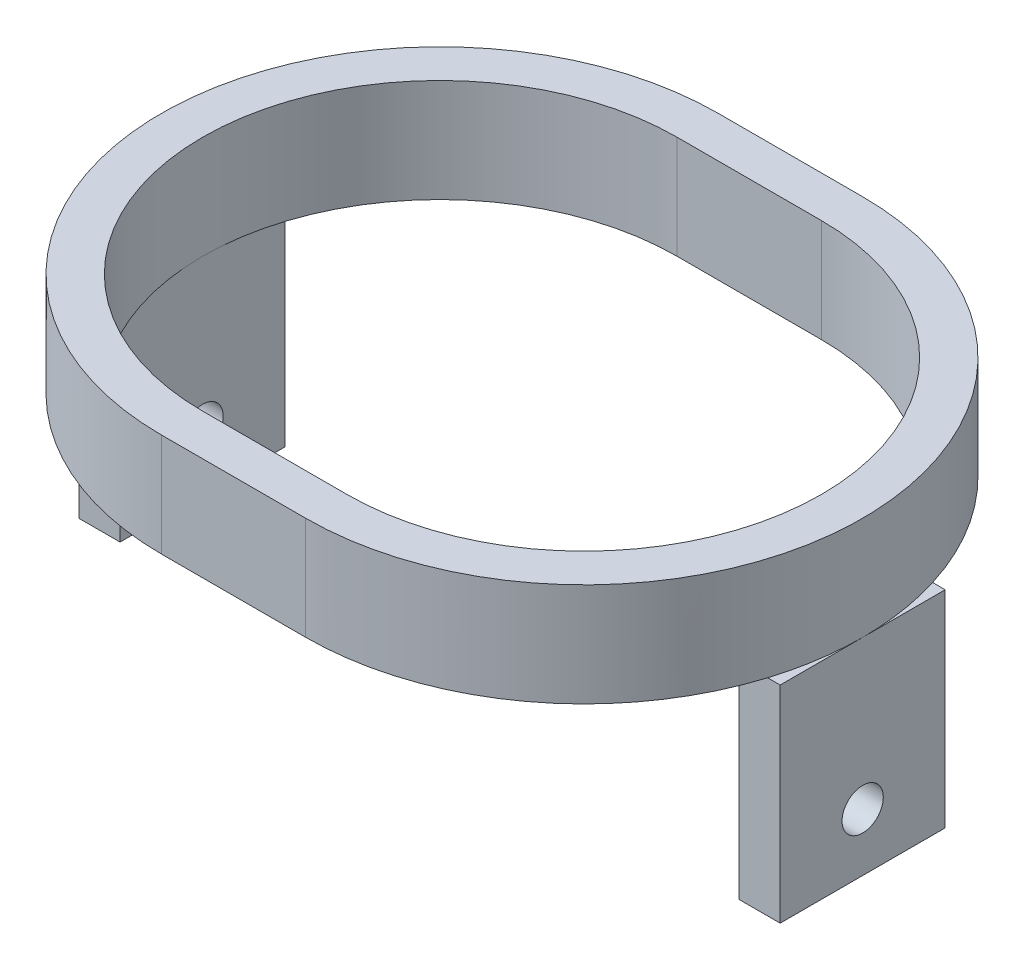
ISO-10303-21;
HEADER;
FILE_DESCRIPTION(('STEP AP214'),'2;1');
FILE_NAME('part.step','',(''),(''),'','','');
FILE_SCHEMA(('AUTOMOTIVE_DESIGN { 1 0 10303 214 1 1 1 1 }'));
ENDSEC;
DATA;
#1=APPLICATION_CONTEXT('core data for automotive mechanical design processes');
#2=APPLICATION_PROTOCOL_DEFINITION('international standard','automotive_design',2000,#1);
#3=PRODUCT_CONTEXT('',#1,'mechanical');
#4=PRODUCT('Part','Part','',(#3));
#5=PRODUCT_RELATED_PRODUCT_CATEGORY('part','',(#4));
#6=PRODUCT_DEFINITION_FORMATION('','',#4);
#7=PRODUCT_DEFINITION_CONTEXT('part definition',#1,'design');
#8=PRODUCT_DEFINITION('design','',#6,#7);
#9=PRODUCT_DEFINITION_SHAPE('','',#8);
#10=(LENGTH_UNIT() NAMED_UNIT(*) SI_UNIT(.MILLI.,.METRE.));
#11=(NAMED_UNIT(*) PLANE_ANGLE_UNIT() SI_UNIT($,.RADIAN.));
#12=(NAMED_UNIT(*) SI_UNIT($,.STERADIAN.) SOLID_ANGLE_UNIT());
#13=UNCERTAINTY_MEASURE_WITH_UNIT(LENGTH_MEASURE(1.E-05),#10,'distance_accuracy_value','');
#14=(GEOMETRIC_REPRESENTATION_CONTEXT(3) GLOBAL_UNCERTAINTY_ASSIGNED_CONTEXT((#13)) GLOBAL_UNIT_ASSIGNED_CONTEXT((#10,
#11,#12)) REPRESENTATION_CONTEXT('',''));
#15=CARTESIAN_POINT('',(0.,0.,0.));
#16=DIRECTION('',(0.,0.,1.));
#17=DIRECTION('',(1.,0.,0.));
#18=AXIS2_PLACEMENT_3D('',#15,#16,#17);
#19=CARTESIAN_POINT('',(-7.00000000000001,0.,0.));
#20=DIRECTION('',(0.,1.,0.));
#21=DIRECTION('',(0.,0.,1.));
#22=AXIS2_PLACEMENT_3D('',#19,#20,#21);
#23=PLANE('',#22);
#24=DIRECTION('',(-1.,0.,0.));
#25=VECTOR('',#24,1.);
#26=CARTESIAN_POINT('',(34.,0.,8.));
#27=LINE('',#26,#25);
#28=CARTESIAN_POINT('',(32.7875939164553,0.,8.));
#29=VERTEX_POINT('',#28);
#30=CARTESIAN_POINT('',(30.,0.,8.));
#31=VERTEX_POINT('',#30);
#32=EDGE_CURVE('E513',#29,#31,#27,.T.);
#33=ORIENTED_EDGE('',*,*,#32,.F.);
#34=CARTESIAN_POINT('',(7.00000000000001,0.,0.));
#35=DIRECTION('',(0.,1.,0.));
#36=DIRECTION('',(0.,0.,1.));
#37=AXIS2_PLACEMENT_3D('',#34,#35,#36);
#38=CIRCLE('',#37,27.);
#39=CARTESIAN_POINT('',(7.00000000000002,0.,27.));
#40=VERTEX_POINT('',#39);
#41=EDGE_CURVE('E334',#40,#29,#38,.T.);
#42=ORIENTED_EDGE('',*,*,#41,.F.);
#43=DIRECTION('',(1.,0.,0.));
#44=VECTOR('',#43,1.);
#45=CARTESIAN_POINT('',(-7.00000000000001,0.,27.));
#46=LINE('',#45,#44);
#47=CARTESIAN_POINT('',(-7.00000000000001,0.,27.));
#48=VERTEX_POINT('',#47);
#49=EDGE_CURVE('E329',#48,#40,#46,.T.);
#50=ORIENTED_EDGE('',*,*,#49,.F.);
#51=CARTESIAN_POINT('',(-7.00000000000001,0.,0.));
#52=DIRECTION('',(0.,1.,0.));
#53=DIRECTION('',(0.,0.,1.));
#54=AXIS2_PLACEMENT_3D('',#51,#52,#53);
#55=CIRCLE('',#54,27.);
#56=CARTESIAN_POINT('',(-32.7875939164553,0.,8.));
#57=VERTEX_POINT('',#56);
#58=EDGE_CURVE('E309',#57,#48,#55,.T.);
#59=ORIENTED_EDGE('',*,*,#58,.F.);
#60=DIRECTION('',(-1.,0.,0.));
#61=VECTOR('',#60,1.);
#62=CARTESIAN_POINT('',(-34.,0.,8.));
#63=LINE('',#62,#61);
#64=CARTESIAN_POINT('',(-30.,0.,8.));
#65=VERTEX_POINT('',#64);
#66=EDGE_CURVE('E66',#65,#57,#63,.T.);
#67=ORIENTED_EDGE('',*,*,#66,.F.);
#68=DIRECTION('',(0.,0.,1.));
#69=VECTOR('',#68,1.);
#70=CARTESIAN_POINT('',(-30.,0.,8.));
#71=LINE('',#70,#69);
#72=CARTESIAN_POINT('',(-30.,0.,0.));
#73=VERTEX_POINT('',#72);
#74=EDGE_CURVE('E11',#73,#65,#71,.T.);
#75=ORIENTED_EDGE('',*,*,#74,.F.);
#76=CARTESIAN_POINT('',(-7.,0.,0.));
#77=DIRECTION('',(0.,1.,0.));
#78=DIRECTION('',(0.,0.,1.));
#79=AXIS2_PLACEMENT_3D('',#76,#77,#78);
#80=CIRCLE('',#79,23.);
#81=CARTESIAN_POINT('',(-7.,0.,23.));
#82=VERTEX_POINT('',#81);
#83=EDGE_CURVE('E263',#73,#82,#80,.T.);
#84=ORIENTED_EDGE('',*,*,#83,.T.);
#85=DIRECTION('',(1.,0.,0.));
#86=VECTOR('',#85,1.);
#87=CARTESIAN_POINT('',(-7.,0.,23.));
#88=LINE('',#87,#86);
#89=CARTESIAN_POINT('',(7.00000000000001,0.,23.));
#90=VERTEX_POINT('',#89);
#91=EDGE_CURVE('E283',#82,#90,#88,.T.);
#92=ORIENTED_EDGE('',*,*,#91,.T.);
#93=CARTESIAN_POINT('',(7.,0.,0.));
#94=DIRECTION('',(0.,1.,0.));
#95=DIRECTION('',(0.,0.,1.));
#96=AXIS2_PLACEMENT_3D('',#93,#94,#95);
#97=CIRCLE('',#96,23.);
#98=CARTESIAN_POINT('',(30.,0.,0.));
#99=VERTEX_POINT('',#98);
#100=EDGE_CURVE('E288',#90,#99,#97,.T.);
#101=ORIENTED_EDGE('',*,*,#100,.T.);
#102=DIRECTION('',(0.,0.,-1.));
#103=VECTOR('',#102,1.);
#104=CARTESIAN_POINT('',(30.,0.,8.));
#105=LINE('',#104,#103);
#106=EDGE_CURVE('E518',#31,#99,#105,.T.);
#107=ORIENTED_EDGE('',*,*,#106,.F.);
#108=EDGE_LOOP('',(#33,#42,#50,#59,#67,#75,#84,#92,#101,#107));
#109=FACE_BOUND('',#108,.T.);
#110=ADVANCED_FACE('F39',(#109),#23,.F.);
#111=CARTESIAN_POINT('',(30.,0.,-8.));
#112=VERTEX_POINT('',#111);
#113=EDGE_CURVE('E517',#99,#112,#105,.T.);
#114=ORIENTED_EDGE('',*,*,#113,.F.);
#115=CARTESIAN_POINT('',(6.99999999999999,0.,-23.));
#116=VERTEX_POINT('',#115);
#117=EDGE_CURVE('E287',#99,#116,#97,.T.);
#118=ORIENTED_EDGE('',*,*,#117,.T.);
#119=DIRECTION('',(-1.,0.,0.));
#120=VECTOR('',#119,1.);
#121=CARTESIAN_POINT('',(-7.,0.,-23.));
#122=LINE('',#121,#120);
#123=CARTESIAN_POINT('',(-7.,0.,-23.));
#124=VERTEX_POINT('',#123);
#125=EDGE_CURVE('E268',#116,#124,#122,.T.);
#126=ORIENTED_EDGE('',*,*,#125,.T.);
#127=EDGE_CURVE('E279',#124,#73,#80,.T.);
#128=ORIENTED_EDGE('',*,*,#127,.T.);
#129=CARTESIAN_POINT('',(-30.,0.,-8.));
#130=VERTEX_POINT('',#129);
#131=EDGE_CURVE('E51',#130,#73,#71,.T.);
#132=ORIENTED_EDGE('',*,*,#131,.F.);
#133=DIRECTION('',(1.,0.,0.));
#134=VECTOR('',#133,1.);
#135=CARTESIAN_POINT('',(-34.,0.,-8.));
#136=LINE('',#135,#134);
#137=CARTESIAN_POINT('',(-32.7875939164553,0.,-8.));
#138=VERTEX_POINT('',#137);
#139=EDGE_CURVE('E49',#138,#130,#136,.T.);
#140=ORIENTED_EDGE('',*,*,#139,.F.);
#141=CARTESIAN_POINT('',(-7.00000000000001,0.,-27.));
#142=VERTEX_POINT('',#141);
#143=EDGE_CURVE('E325',#142,#138,#55,.T.);
#144=ORIENTED_EDGE('',*,*,#143,.F.);
#145=DIRECTION('',(-1.,0.,0.));
#146=VECTOR('',#145,1.);
#147=CARTESIAN_POINT('',(-7.00000000000001,0.,-27.));
#148=LINE('',#147,#146);
#149=CARTESIAN_POINT('',(7.,0.,-27.));
#150=VERTEX_POINT('',#149);
#151=EDGE_CURVE('E315',#150,#142,#148,.T.);
#152=ORIENTED_EDGE('',*,*,#151,.F.);
#153=CARTESIAN_POINT('',(32.7875939164553,0.,-8.));
#154=VERTEX_POINT('',#153);
#155=EDGE_CURVE('E333',#154,#150,#38,.T.);
#156=ORIENTED_EDGE('',*,*,#155,.F.);
#157=DIRECTION('',(1.,0.,0.));
#158=VECTOR('',#157,1.);
#159=CARTESIAN_POINT('',(34.,0.,-8.));
#160=LINE('',#159,#158);
#161=EDGE_CURVE('E58',#112,#154,#160,.T.);
#162=ORIENTED_EDGE('',*,*,#161,.F.);
#163=EDGE_LOOP('',(#114,#118,#126,#128,#132,#140,#144,#152,#156,#162));
#164=FACE_BOUND('',#163,.T.);
#165=ADVANCED_FACE('F408',(#164),#23,.F.);
#166=CARTESIAN_POINT('',(-7.00000000000001,10.,0.));
#167=DIRECTION('',(0.,1.,0.));
#168=DIRECTION('',(0.,0.,1.));
#169=AXIS2_PLACEMENT_3D('',#166,#167,#168);
#170=PLANE('',#169);
#171=CARTESIAN_POINT('',(-7.00000000000001,10.,0.));
#172=DIRECTION('',(0.,1.,0.));
#173=DIRECTION('',(0.,0.,1.));
#174=AXIS2_PLACEMENT_3D('',#171,#172,#173);
#175=CIRCLE('',#174,27.);
#176=CARTESIAN_POINT('',(-7.00000000000001,10.,-27.));
#177=VERTEX_POINT('',#176);
#178=CARTESIAN_POINT('',(-7.00000000000001,10.,27.));
#179=VERTEX_POINT('',#178);
#180=EDGE_CURVE('E310',#177,#179,#175,.T.);
#181=ORIENTED_EDGE('',*,*,#180,.T.);
#182=DIRECTION('',(1.,0.,0.));
#183=VECTOR('',#182,1.);
#184=CARTESIAN_POINT('',(-7.00000000000001,10.,27.));
#185=LINE('',#184,#183);
#186=CARTESIAN_POINT('',(7.00000000000002,10.,27.));
#187=VERTEX_POINT('',#186);
#188=EDGE_CURVE('E314',#179,#187,#185,.T.);
#189=ORIENTED_EDGE('',*,*,#188,.T.);
#190=CARTESIAN_POINT('',(7.00000000000001,10.,0.));
#191=DIRECTION('',(0.,1.,0.));
#192=DIRECTION('',(0.,0.,1.));
#193=AXIS2_PLACEMENT_3D('',#190,#191,#192);
#194=CIRCLE('',#193,27.);
#195=CARTESIAN_POINT('',(7.,10.,-27.));
#196=VERTEX_POINT('',#195);
#197=EDGE_CURVE('E318',#187,#196,#194,.T.);
#198=ORIENTED_EDGE('',*,*,#197,.T.);
#199=DIRECTION('',(-1.,0.,0.));
#200=VECTOR('',#199,1.);
#201=CARTESIAN_POINT('',(-7.00000000000001,10.,-27.));
#202=LINE('',#201,#200);
#203=EDGE_CURVE('E321',#196,#177,#202,.T.);
#204=ORIENTED_EDGE('',*,*,#203,.T.);
#205=EDGE_LOOP('',(#181,#189,#198,#204));
#206=FACE_BOUND('',#205,.T.);
#207=DIRECTION('',(1.,0.,0.));
#208=VECTOR('',#207,1.);
#209=CARTESIAN_POINT('',(-7.,10.,23.));
#210=LINE('',#209,#208);
#211=CARTESIAN_POINT('',(-7.,10.,23.));
#212=VERTEX_POINT('',#211);
#213=CARTESIAN_POINT('',(7.00000000000001,10.,23.));
#214=VERTEX_POINT('',#213);
#215=EDGE_CURVE('E267',#212,#214,#210,.T.);
#216=ORIENTED_EDGE('',*,*,#215,.F.);
#217=CARTESIAN_POINT('',(-7.,10.,0.));
#218=DIRECTION('',(0.,1.,0.));
#219=DIRECTION('',(0.,0.,1.));
#220=AXIS2_PLACEMENT_3D('',#217,#218,#219);
#221=CIRCLE('',#220,23.);
#222=CARTESIAN_POINT('',(-7.,10.,-23.));
#223=VERTEX_POINT('',#222);
#224=EDGE_CURVE('E264',#223,#212,#221,.T.);
#225=ORIENTED_EDGE('',*,*,#224,.F.);
#226=DIRECTION('',(-1.,0.,0.));
#227=VECTOR('',#226,1.);
#228=CARTESIAN_POINT('',(-7.,10.,-23.));
#229=LINE('',#228,#227);
#230=CARTESIAN_POINT('',(6.99999999999999,10.,-23.));
#231=VERTEX_POINT('',#230);
#232=EDGE_CURVE('E275',#231,#223,#229,.T.);
#233=ORIENTED_EDGE('',*,*,#232,.F.);
#234=CARTESIAN_POINT('',(7.,10.,0.));
#235=DIRECTION('',(0.,1.,0.));
#236=DIRECTION('',(0.,0.,1.));
#237=AXIS2_PLACEMENT_3D('',#234,#235,#236);
#238=CIRCLE('',#237,23.);
#239=EDGE_CURVE('E271',#214,#231,#238,.T.);
#240=ORIENTED_EDGE('',*,*,#239,.F.);
#241=EDGE_LOOP('',(#216,#225,#233,#240));
#242=FACE_BOUND('',#241,.T.);
#243=ADVANCED_FACE('F402',(#206,#242),#170,.T.);
#244=CARTESIAN_POINT('',(-7.00000000000001,10.,0.));
#245=DIRECTION('',(0.,-1.,0.));
#246=DIRECTION('',(0.,0.,-1.));
#247=AXIS2_PLACEMENT_3D('',#244,#245,#246);
#248=CYLINDRICAL_SURFACE('',#247,27.);
#249=ORIENTED_EDGE('',*,*,#143,.T.);
#250=CARTESIAN_POINT('',(-34.,0.,0.));
#251=VERTEX_POINT('',#250);
#252=EDGE_CURVE('E330',#138,#251,#55,.T.);
#253=ORIENTED_EDGE('',*,*,#252,.T.);
#254=EDGE_CURVE('E385',#251,#57,#55,.T.);
#255=ORIENTED_EDGE('',*,*,#254,.T.);
#256=ORIENTED_EDGE('',*,*,#58,.T.);
#257=DIRECTION('',(0.,-1.,0.));
#258=VECTOR('',#257,1.);
#259=CARTESIAN_POINT('',(-7.00000000000001,10.,27.));
#260=LINE('',#259,#258);
#261=EDGE_CURVE('E350',#179,#48,#260,.T.);
#262=ORIENTED_EDGE('',*,*,#261,.F.);
#263=ORIENTED_EDGE('',*,*,#180,.F.);
#264=DIRECTION('',(0.,-1.,0.));
#265=VECTOR('',#264,1.);
#266=CARTESIAN_POINT('',(-7.00000000000001,10.,-27.));
#267=LINE('',#266,#265);
#268=EDGE_CURVE('E324',#177,#142,#267,.T.);
#269=ORIENTED_EDGE('',*,*,#268,.T.);
#270=EDGE_LOOP('',(#249,#253,#255,#256,#262,#263,#269));
#271=FACE_BOUND('',#270,.T.);
#272=ADVANCED_FACE('F41',(#271),#248,.T.);
#273=CARTESIAN_POINT('',(-7.00000000000001,10.,27.));
#274=DIRECTION('',(0.,0.,-1.));
#275=DIRECTION('',(-1.,0.,0.));
#276=AXIS2_PLACEMENT_3D('',#273,#274,#275);
#277=PLANE('',#276);
#278=ORIENTED_EDGE('',*,*,#49,.T.);
#279=DIRECTION('',(0.,-1.,0.));
#280=VECTOR('',#279,1.);
#281=CARTESIAN_POINT('',(7.00000000000002,10.,27.));
#282=LINE('',#281,#280);
#283=EDGE_CURVE('E347',#187,#40,#282,.T.);
#284=ORIENTED_EDGE('',*,*,#283,.F.);
#285=ORIENTED_EDGE('',*,*,#188,.F.);
#286=ORIENTED_EDGE('',*,*,#261,.T.);
#287=EDGE_LOOP('',(#278,#284,#285,#286));
#288=FACE_BOUND('',#287,.T.);
#289=ADVANCED_FACE('F394',(#288),#277,.F.);
#290=CARTESIAN_POINT('',(7.00000000000001,10.,0.));
#291=DIRECTION('',(0.,-1.,0.));
#292=DIRECTION('',(0.,0.,-1.));
#293=AXIS2_PLACEMENT_3D('',#290,#291,#292);
#294=CYLINDRICAL_SURFACE('',#293,27.);
#295=ORIENTED_EDGE('',*,*,#41,.T.);
#296=CARTESIAN_POINT('',(7.00000000000001,0.,0.));
#297=DIRECTION('',(0.,1.,0.));
#298=DIRECTION('',(0.,0.,1.));
#299=AXIS2_PLACEMENT_3D('',#296,#297,#298);
#300=CIRCLE('',#299,27.);
#301=CARTESIAN_POINT('',(34.,0.,0.));
#302=VERTEX_POINT('',#301);
#303=EDGE_CURVE('E214',#29,#302,#300,.T.);
#304=ORIENTED_EDGE('',*,*,#303,.T.);
#305=EDGE_CURVE('E209',#302,#154,#300,.T.);
#306=ORIENTED_EDGE('',*,*,#305,.T.);
#307=ORIENTED_EDGE('',*,*,#155,.T.);
#308=DIRECTION('',(0.,-1.,0.));
#309=VECTOR('',#308,1.);
#310=CARTESIAN_POINT('',(7.,10.,-27.));
#311=LINE('',#310,#309);
#312=EDGE_CURVE('E343',#196,#150,#311,.T.);
#313=ORIENTED_EDGE('',*,*,#312,.F.);
#314=ORIENTED_EDGE('',*,*,#197,.F.);
#315=ORIENTED_EDGE('',*,*,#283,.T.);
#316=EDGE_LOOP('',(#295,#304,#306,#307,#313,#314,#315));
#317=FACE_BOUND('',#316,.T.);
#318=ADVANCED_FACE('F397',(#317),#294,.T.);
#319=CARTESIAN_POINT('',(-7.00000000000001,10.,-27.));
#320=DIRECTION('',(0.,0.,1.));
#321=DIRECTION('',(1.,0.,0.));
#322=AXIS2_PLACEMENT_3D('',#319,#320,#321);
#323=PLANE('',#322);
#324=ORIENTED_EDGE('',*,*,#151,.T.);
#325=ORIENTED_EDGE('',*,*,#268,.F.);
#326=ORIENTED_EDGE('',*,*,#203,.F.);
#327=ORIENTED_EDGE('',*,*,#312,.T.);
#328=EDGE_LOOP('',(#324,#325,#326,#327));
#329=FACE_BOUND('',#328,.T.);
#330=ADVANCED_FACE('F410',(#329),#323,.F.);
#331=CARTESIAN_POINT('',(-7.,10.,0.));
#332=DIRECTION('',(0.,-1.,0.));
#333=DIRECTION('',(0.,0.,-1.));
#334=AXIS2_PLACEMENT_3D('',#331,#332,#333);
#335=CYLINDRICAL_SURFACE('',#334,23.);
#336=ORIENTED_EDGE('',*,*,#127,.F.);
#337=DIRECTION('',(0.,-1.,0.));
#338=VECTOR('',#337,1.);
#339=CARTESIAN_POINT('',(-7.,10.,-23.));
#340=LINE('',#339,#338);
#341=EDGE_CURVE('E278',#223,#124,#340,.T.);
#342=ORIENTED_EDGE('',*,*,#341,.F.);
#343=ORIENTED_EDGE('',*,*,#224,.T.);
#344=DIRECTION('',(0.,-1.,0.));
#345=VECTOR('',#344,1.);
#346=CARTESIAN_POINT('',(-7.,10.,23.));
#347=LINE('',#346,#345);
#348=EDGE_CURVE('E305',#212,#82,#347,.T.);
#349=ORIENTED_EDGE('',*,*,#348,.T.);
#350=ORIENTED_EDGE('',*,*,#83,.F.);
#351=EDGE_LOOP('',(#336,#342,#343,#349,#350));
#352=FACE_BOUND('',#351,.T.);
#353=ADVANCED_FACE('F412',(#352),#335,.F.);
#354=CARTESIAN_POINT('',(-7.,10.,23.));
#355=DIRECTION('',(0.,0.,-1.));
#356=DIRECTION('',(-1.,0.,0.));
#357=AXIS2_PLACEMENT_3D('',#354,#355,#356);
#358=PLANE('',#357);
#359=ORIENTED_EDGE('',*,*,#91,.F.);
#360=ORIENTED_EDGE('',*,*,#348,.F.);
#361=ORIENTED_EDGE('',*,*,#215,.T.);
#362=DIRECTION('',(0.,-1.,0.));
#363=VECTOR('',#362,1.);
#364=CARTESIAN_POINT('',(7.00000000000001,10.,23.));
#365=LINE('',#364,#363);
#366=EDGE_CURVE('E302',#214,#90,#365,.T.);
#367=ORIENTED_EDGE('',*,*,#366,.T.);
#368=EDGE_LOOP('',(#359,#360,#361,#367));
#369=FACE_BOUND('',#368,.T.);
#370=ADVANCED_FACE('F419',(#369),#358,.T.);
#371=CARTESIAN_POINT('',(7.,10.,0.));
#372=DIRECTION('',(0.,-1.,0.));
#373=DIRECTION('',(0.,0.,-1.));
#374=AXIS2_PLACEMENT_3D('',#371,#372,#373);
#375=CYLINDRICAL_SURFACE('',#374,23.);
#376=ORIENTED_EDGE('',*,*,#100,.F.);
#377=ORIENTED_EDGE('',*,*,#366,.F.);
#378=ORIENTED_EDGE('',*,*,#239,.T.);
#379=DIRECTION('',(0.,-1.,0.));
#380=VECTOR('',#379,1.);
#381=CARTESIAN_POINT('',(6.99999999999999,10.,-23.));
#382=LINE('',#381,#380);
#383=EDGE_CURVE('E298',#231,#116,#382,.T.);
#384=ORIENTED_EDGE('',*,*,#383,.T.);
#385=ORIENTED_EDGE('',*,*,#117,.F.);
#386=EDGE_LOOP('',(#376,#377,#378,#384,#385));
#387=FACE_BOUND('',#386,.T.);
#388=ADVANCED_FACE('F435',(#387),#375,.F.);
#389=CARTESIAN_POINT('',(-7.,10.,-23.));
#390=DIRECTION('',(0.,0.,1.));
#391=DIRECTION('',(1.,0.,0.));
#392=AXIS2_PLACEMENT_3D('',#389,#390,#391);
#393=PLANE('',#392);
#394=ORIENTED_EDGE('',*,*,#125,.F.);
#395=ORIENTED_EDGE('',*,*,#383,.F.);
#396=ORIENTED_EDGE('',*,*,#232,.T.);
#397=ORIENTED_EDGE('',*,*,#341,.T.);
#398=EDGE_LOOP('',(#394,#395,#396,#397));
#399=FACE_BOUND('',#398,.T.);
#400=ADVANCED_FACE('F439',(#399),#393,.T.);
#401=CARTESIAN_POINT('',(0.,0.,0.));
#402=DIRECTION('',(0.,-1.,0.));
#403=DIRECTION('',(0.,0.,-1.));
#404=AXIS2_PLACEMENT_3D('',#401,#402,#403);
#405=PLANE('',#404);
#406=ORIENTED_EDGE('',*,*,#252,.F.);
#407=CARTESIAN_POINT('',(-34.,0.,-8.));
#408=VERTEX_POINT('',#407);
#409=EDGE_CURVE('E238',#408,#138,#136,.T.);
#410=ORIENTED_EDGE('',*,*,#409,.F.);
#411=DIRECTION('',(0.,0.,-1.));
#412=VECTOR('',#411,1.);
#413=CARTESIAN_POINT('',(-34.,0.,8.));
#414=LINE('',#413,#412);
#415=EDGE_CURVE('E239',#251,#408,#414,.T.);
#416=ORIENTED_EDGE('',*,*,#415,.F.);
#417=EDGE_LOOP('',(#406,#410,#416));
#418=FACE_BOUND('',#417,.T.);
#419=ADVANCED_FACE('F380',(#418),#405,.F.);
#420=CARTESIAN_POINT('',(-34.,-20.,8.));
#421=DIRECTION('',(1.,0.,0.));
#422=DIRECTION('',(0.,0.,-1.));
#423=AXIS2_PLACEMENT_3D('',#420,#421,#422);
#424=PLANE('',#423);
#425=CARTESIAN_POINT('',(-34.,-14.4265330437908,0.));
#426=DIRECTION('',(1.,0.,0.));
#427=DIRECTION('',(0.,0.,-1.));
#428=AXIS2_PLACEMENT_3D('',#425,#426,#427);
#429=CIRCLE('',#428,2.);
#430=CARTESIAN_POINT('',(-34.,-14.4265330437908,-2.));
#431=VERTEX_POINT('',#430);
#432=EDGE_CURVE('E492',#431,#431,#429,.T.);
#433=ORIENTED_EDGE('',*,*,#432,.T.);
#434=EDGE_LOOP('',(#433));
#435=FACE_BOUND('',#434,.T.);
#436=CARTESIAN_POINT('',(-34.,0.,8.));
#437=VERTEX_POINT('',#436);
#438=EDGE_CURVE('E234',#437,#251,#414,.T.);
#439=ORIENTED_EDGE('',*,*,#438,.T.);
#440=ORIENTED_EDGE('',*,*,#415,.T.);
#441=DIRECTION('',(0.,1.,0.));
#442=VECTOR('',#441,1.);
#443=CARTESIAN_POINT('',(-34.,-20.,-8.));
#444=LINE('',#443,#442);
#445=CARTESIAN_POINT('',(-34.,-20.,-8.));
#446=VERTEX_POINT('',#445);
#447=EDGE_CURVE('E259',#446,#408,#444,.T.);
#448=ORIENTED_EDGE('',*,*,#447,.F.);
#449=DIRECTION('',(0.,0.,-1.));
#450=VECTOR('',#449,1.);
#451=CARTESIAN_POINT('',(-34.,-20.,8.));
#452=LINE('',#451,#450);
#453=CARTESIAN_POINT('',(-34.,-20.,8.));
#454=VERTEX_POINT('',#453);
#455=EDGE_CURVE('E220',#454,#446,#452,.T.);
#456=ORIENTED_EDGE('',*,*,#455,.F.);
#457=DIRECTION('',(0.,1.,0.));
#458=VECTOR('',#457,1.);
#459=CARTESIAN_POINT('',(-34.,-20.,8.));
#460=LINE('',#459,#458);
#461=EDGE_CURVE('E233',#454,#437,#460,.T.);
#462=ORIENTED_EDGE('',*,*,#461,.T.);
#463=EDGE_LOOP('',(#439,#440,#448,#456,#462));
#464=FACE_BOUND('',#463,.T.);
#465=ADVANCED_FACE('F374',(#435,#464),#424,.F.);
#466=CARTESIAN_POINT('',(-34.,-20.,-8.));
#467=DIRECTION('',(0.,0.,1.));
#468=DIRECTION('',(1.,0.,0.));
#469=AXIS2_PLACEMENT_3D('',#466,#467,#468);
#470=PLANE('',#469);
#471=ORIENTED_EDGE('',*,*,#409,.T.);
#472=ORIENTED_EDGE('',*,*,#139,.T.);
#473=DIRECTION('',(0.,1.,0.));
#474=VECTOR('',#473,1.);
#475=CARTESIAN_POINT('',(-30.,-20.,-8.));
#476=LINE('',#475,#474);
#477=CARTESIAN_POINT('',(-30.,-20.,-8.));
#478=VERTEX_POINT('',#477);
#479=EDGE_CURVE('E255',#478,#130,#476,.T.);
#480=ORIENTED_EDGE('',*,*,#479,.F.);
#481=DIRECTION('',(1.,0.,0.));
#482=VECTOR('',#481,1.);
#483=CARTESIAN_POINT('',(-34.,-20.,-8.));
#484=LINE('',#483,#482);
#485=EDGE_CURVE('E224',#446,#478,#484,.T.);
#486=ORIENTED_EDGE('',*,*,#485,.F.);
#487=ORIENTED_EDGE('',*,*,#447,.T.);
#488=EDGE_LOOP('',(#471,#472,#480,#486,#487));
#489=FACE_BOUND('',#488,.T.);
#490=ADVANCED_FACE('F359',(#489),#470,.F.);
#491=CARTESIAN_POINT('',(-30.,-20.,8.));
#492=DIRECTION('',(-1.,0.,0.));
#493=DIRECTION('',(0.,0.,1.));
#494=AXIS2_PLACEMENT_3D('',#491,#492,#493);
#495=PLANE('',#494);
#496=CARTESIAN_POINT('',(-30.,-14.4265330437908,0.));
#497=DIRECTION('',(-1.,0.,0.));
#498=DIRECTION('',(0.,0.,1.));
#499=AXIS2_PLACEMENT_3D('',#496,#497,#498);
#500=CIRCLE('',#499,2.);
#501=CARTESIAN_POINT('',(-30.,-14.4265330437908,2.));
#502=VERTEX_POINT('',#501);
#503=EDGE_CURVE('E495',#502,#502,#500,.T.);
#504=ORIENTED_EDGE('',*,*,#503,.T.);
#505=EDGE_LOOP('',(#504));
#506=FACE_BOUND('',#505,.T.);
#507=ORIENTED_EDGE('',*,*,#131,.T.);
#508=ORIENTED_EDGE('',*,*,#74,.T.);
#509=DIRECTION('',(0.,1.,0.));
#510=VECTOR('',#509,1.);
#511=CARTESIAN_POINT('',(-30.,-20.,8.));
#512=LINE('',#511,#510);
#513=CARTESIAN_POINT('',(-30.,-20.,8.));
#514=VERTEX_POINT('',#513);
#515=EDGE_CURVE('E251',#514,#65,#512,.T.);
#516=ORIENTED_EDGE('',*,*,#515,.F.);
#517=DIRECTION('',(0.,0.,1.));
#518=VECTOR('',#517,1.);
#519=CARTESIAN_POINT('',(-30.,-20.,8.));
#520=LINE('',#519,#518);
#521=EDGE_CURVE('E227',#478,#514,#520,.T.);
#522=ORIENTED_EDGE('',*,*,#521,.F.);
#523=ORIENTED_EDGE('',*,*,#479,.T.);
#524=EDGE_LOOP('',(#507,#508,#516,#522,#523));
#525=FACE_BOUND('',#524,.T.);
#526=ADVANCED_FACE('F365',(#506,#525),#495,.F.);
#527=CARTESIAN_POINT('',(-34.,-20.,8.));
#528=DIRECTION('',(0.,0.,-1.));
#529=DIRECTION('',(-1.,0.,0.));
#530=AXIS2_PLACEMENT_3D('',#527,#528,#529);
#531=PLANE('',#530);
#532=ORIENTED_EDGE('',*,*,#66,.T.);
#533=EDGE_CURVE('E245',#57,#437,#63,.T.);
#534=ORIENTED_EDGE('',*,*,#533,.T.);
#535=ORIENTED_EDGE('',*,*,#461,.F.);
#536=DIRECTION('',(-1.,0.,0.));
#537=VECTOR('',#536,1.);
#538=CARTESIAN_POINT('',(-34.,-20.,8.));
#539=LINE('',#538,#537);
#540=EDGE_CURVE('E230',#514,#454,#539,.T.);
#541=ORIENTED_EDGE('',*,*,#540,.F.);
#542=ORIENTED_EDGE('',*,*,#515,.T.);
#543=EDGE_LOOP('',(#532,#534,#535,#541,#542));
#544=FACE_BOUND('',#543,.T.);
#545=ADVANCED_FACE('F451',(#544),#531,.F.);
#546=CARTESIAN_POINT('',(0.,-20.,0.));
#547=DIRECTION('',(0.,-1.,0.));
#548=DIRECTION('',(0.,0.,-1.));
#549=AXIS2_PLACEMENT_3D('',#546,#547,#548);
#550=PLANE('',#549);
#551=ORIENTED_EDGE('',*,*,#455,.T.);
#552=ORIENTED_EDGE('',*,*,#485,.T.);
#553=ORIENTED_EDGE('',*,*,#521,.T.);
#554=ORIENTED_EDGE('',*,*,#540,.T.);
#555=EDGE_LOOP('',(#551,#552,#553,#554));
#556=FACE_BOUND('',#555,.T.);
#557=ADVANCED_FACE('F369',(#556),#550,.T.);
#558=ORIENTED_EDGE('',*,*,#254,.F.);
#559=ORIENTED_EDGE('',*,*,#438,.F.);
#560=ORIENTED_EDGE('',*,*,#533,.F.);
#561=EDGE_LOOP('',(#558,#559,#560));
#562=FACE_BOUND('',#561,.T.);
#563=ADVANCED_FACE('F456',(#562),#405,.F.);
#564=CARTESIAN_POINT('',(0.,0.,0.));
#565=DIRECTION('',(0.,1.,0.));
#566=DIRECTION('',(0.,0.,1.));
#567=AXIS2_PLACEMENT_3D('',#564,#565,#566);
#568=PLANE('',#567);
#569=ORIENTED_EDGE('',*,*,#303,.F.);
#570=CARTESIAN_POINT('',(34.,0.,8.));
#571=VERTEX_POINT('',#570);
#572=EDGE_CURVE('E514',#571,#29,#27,.T.);
#573=ORIENTED_EDGE('',*,*,#572,.F.);
#574=DIRECTION('',(0.,0.,1.));
#575=VECTOR('',#574,1.);
#576=CARTESIAN_POINT('',(34.,0.,8.));
#577=LINE('',#576,#575);
#578=EDGE_CURVE('E206',#302,#571,#577,.T.);
#579=ORIENTED_EDGE('',*,*,#578,.F.);
#580=EDGE_LOOP('',(#569,#573,#579));
#581=FACE_BOUND('',#580,.T.);
#582=ADVANCED_FACE('F459',(#581),#568,.T.);
#583=CARTESIAN_POINT('',(34.,-20.,8.));
#584=DIRECTION('',(-1.,0.,0.));
#585=DIRECTION('',(0.,0.,1.));
#586=AXIS2_PLACEMENT_3D('',#583,#584,#585);
#587=PLANE('',#586);
#588=CARTESIAN_POINT('',(34.,-14.4265330437908,0.));
#589=DIRECTION('',(1.,0.,0.));
#590=DIRECTION('',(0.,0.,-1.));
#591=AXIS2_PLACEMENT_3D('',#588,#589,#590);
#592=CIRCLE('',#591,2.);
#593=CARTESIAN_POINT('',(34.,-14.4265330437908,-2.));
#594=VERTEX_POINT('',#593);
#595=EDGE_CURVE('E504',#594,#594,#592,.T.);
#596=ORIENTED_EDGE('',*,*,#595,.F.);
#597=EDGE_LOOP('',(#596));
#598=FACE_BOUND('',#597,.T.);
#599=CARTESIAN_POINT('',(34.,0.,-8.));
#600=VERTEX_POINT('',#599);
#601=EDGE_CURVE('E500',#600,#302,#577,.T.);
#602=ORIENTED_EDGE('',*,*,#601,.T.);
#603=ORIENTED_EDGE('',*,*,#578,.T.);
#604=DIRECTION('',(0.,1.,0.));
#605=VECTOR('',#604,1.);
#606=CARTESIAN_POINT('',(34.,-20.,8.));
#607=LINE('',#606,#605);
#608=CARTESIAN_POINT('',(34.,-20.,8.));
#609=VERTEX_POINT('',#608);
#610=EDGE_CURVE('E185',#609,#571,#607,.T.);
#611=ORIENTED_EDGE('',*,*,#610,.F.);
#612=DIRECTION('',(0.,0.,1.));
#613=VECTOR('',#612,1.);
#614=CARTESIAN_POINT('',(34.,-20.,8.));
#615=LINE('',#614,#613);
#616=CARTESIAN_POINT('',(34.,-20.,-8.));
#617=VERTEX_POINT('',#616);
#618=EDGE_CURVE('E192',#617,#609,#615,.T.);
#619=ORIENTED_EDGE('',*,*,#618,.F.);
#620=DIRECTION('',(0.,1.,0.));
#621=VECTOR('',#620,1.);
#622=CARTESIAN_POINT('',(34.,-20.,-8.));
#623=LINE('',#622,#621);
#624=EDGE_CURVE('E510',#617,#600,#623,.T.);
#625=ORIENTED_EDGE('',*,*,#624,.T.);
#626=EDGE_LOOP('',(#602,#603,#611,#619,#625));
#627=FACE_BOUND('',#626,.T.);
#628=ADVANCED_FACE('F204',(#598,#627),#587,.F.);
#629=CARTESIAN_POINT('',(34.,-20.,8.));
#630=DIRECTION('',(0.,0.,-1.));
#631=DIRECTION('',(-1.,0.,0.));
#632=AXIS2_PLACEMENT_3D('',#629,#630,#631);
#633=PLANE('',#632);
#634=ORIENTED_EDGE('',*,*,#572,.T.);
#635=ORIENTED_EDGE('',*,*,#32,.T.);
#636=DIRECTION('',(0.,1.,0.));
#637=VECTOR('',#636,1.);
#638=CARTESIAN_POINT('',(30.,-20.,8.));
#639=LINE('',#638,#637);
#640=CARTESIAN_POINT('',(30.,-20.,8.));
#641=VERTEX_POINT('',#640);
#642=EDGE_CURVE('E187',#641,#31,#639,.T.);
#643=ORIENTED_EDGE('',*,*,#642,.F.);
#644=DIRECTION('',(-1.,0.,0.));
#645=VECTOR('',#644,1.);
#646=CARTESIAN_POINT('',(34.,-20.,8.));
#647=LINE('',#646,#645);
#648=EDGE_CURVE('E180',#609,#641,#647,.T.);
#649=ORIENTED_EDGE('',*,*,#648,.F.);
#650=ORIENTED_EDGE('',*,*,#610,.T.);
#651=EDGE_LOOP('',(#634,#635,#643,#649,#650));
#652=FACE_BOUND('',#651,.T.);
#653=ADVANCED_FACE('F183',(#652),#633,.F.);
#654=CARTESIAN_POINT('',(30.,-20.,8.));
#655=DIRECTION('',(1.,0.,0.));
#656=DIRECTION('',(0.,0.,-1.));
#657=AXIS2_PLACEMENT_3D('',#654,#655,#656);
#658=PLANE('',#657);
#659=CARTESIAN_POINT('',(30.,-14.4265330437908,0.));
#660=DIRECTION('',(1.,0.,0.));
#661=DIRECTION('',(0.,0.,-1.));
#662=AXIS2_PLACEMENT_3D('',#659,#660,#661);
#663=CIRCLE('',#662,2.);
#664=CARTESIAN_POINT('',(30.,-14.4265330437908,-2.));
#665=VERTEX_POINT('',#664);
#666=EDGE_CURVE('E43',#665,#665,#663,.T.);
#667=ORIENTED_EDGE('',*,*,#666,.T.);
#668=EDGE_LOOP('',(#667));
#669=FACE_BOUND('',#668,.T.);
#670=ORIENTED_EDGE('',*,*,#106,.T.);
#671=ORIENTED_EDGE('',*,*,#113,.T.);
#672=DIRECTION('',(0.,1.,0.));
#673=VECTOR('',#672,1.);
#674=CARTESIAN_POINT('',(30.,-20.,-8.));
#675=LINE('',#674,#673);
#676=CARTESIAN_POINT('',(30.,-20.,-8.));
#677=VERTEX_POINT('',#676);
#678=EDGE_CURVE('E216',#677,#112,#675,.T.);
#679=ORIENTED_EDGE('',*,*,#678,.F.);
#680=DIRECTION('',(0.,0.,-1.));
#681=VECTOR('',#680,1.);
#682=CARTESIAN_POINT('',(30.,-20.,8.));
#683=LINE('',#682,#681);
#684=EDGE_CURVE('E191',#641,#677,#683,.T.);
#685=ORIENTED_EDGE('',*,*,#684,.F.);
#686=ORIENTED_EDGE('',*,*,#642,.T.);
#687=EDGE_LOOP('',(#670,#671,#679,#685,#686));
#688=FACE_BOUND('',#687,.T.);
#689=ADVANCED_FACE('F468',(#669,#688),#658,.F.);
#690=CARTESIAN_POINT('',(34.,-20.,-8.));
#691=DIRECTION('',(0.,0.,1.));
#692=DIRECTION('',(1.,0.,0.));
#693=AXIS2_PLACEMENT_3D('',#690,#691,#692);
#694=PLANE('',#693);
#695=ORIENTED_EDGE('',*,*,#161,.T.);
#696=EDGE_CURVE('E521',#154,#600,#160,.T.);
#697=ORIENTED_EDGE('',*,*,#696,.T.);
#698=ORIENTED_EDGE('',*,*,#624,.F.);
#699=DIRECTION('',(1.,0.,0.));
#700=VECTOR('',#699,1.);
#701=CARTESIAN_POINT('',(34.,-20.,-8.));
#702=LINE('',#701,#700);
#703=EDGE_CURVE('E197',#677,#617,#702,.T.);
#704=ORIENTED_EDGE('',*,*,#703,.F.);
#705=ORIENTED_EDGE('',*,*,#678,.T.);
#706=EDGE_LOOP('',(#695,#697,#698,#704,#705));
#707=FACE_BOUND('',#706,.T.);
#708=ADVANCED_FACE('F471',(#707),#694,.F.);
#709=CARTESIAN_POINT('',(0.,-20.,0.));
#710=DIRECTION('',(0.,1.,0.));
#711=DIRECTION('',(0.,0.,1.));
#712=AXIS2_PLACEMENT_3D('',#709,#710,#711);
#713=PLANE('',#712);
#714=ORIENTED_EDGE('',*,*,#618,.T.);
#715=ORIENTED_EDGE('',*,*,#648,.T.);
#716=ORIENTED_EDGE('',*,*,#684,.T.);
#717=ORIENTED_EDGE('',*,*,#703,.T.);
#718=EDGE_LOOP('',(#714,#715,#716,#717));
#719=FACE_BOUND('',#718,.T.);
#720=ADVANCED_FACE('F195',(#719),#713,.F.);
#721=ORIENTED_EDGE('',*,*,#305,.F.);
#722=ORIENTED_EDGE('',*,*,#601,.F.);
#723=ORIENTED_EDGE('',*,*,#696,.F.);
#724=EDGE_LOOP('',(#721,#722,#723));
#725=FACE_BOUND('',#724,.T.);
#726=ADVANCED_FACE('F475',(#725),#568,.T.);
#727=CARTESIAN_POINT('',(-34.,-14.4265330437908,0.));
#728=DIRECTION('',(1.,0.,0.));
#729=DIRECTION('',(0.,0.,-1.));
#730=AXIS2_PLACEMENT_3D('',#727,#728,#729);
#731=CYLINDRICAL_SURFACE('',#730,2.);
#732=ORIENTED_EDGE('',*,*,#595,.T.);
#733=EDGE_LOOP('',(#732));
#734=FACE_BOUND('',#733,.T.);
#735=ORIENTED_EDGE('',*,*,#666,.F.);
#736=EDGE_LOOP('',(#735));
#737=FACE_BOUND('',#736,.T.);
#738=ADVANCED_FACE('F478',(#734,#737),#731,.F.);
#739=ORIENTED_EDGE('',*,*,#432,.F.);
#740=EDGE_LOOP('',(#739));
#741=FACE_BOUND('',#740,.T.);
#742=ORIENTED_EDGE('',*,*,#503,.F.);
#743=EDGE_LOOP('',(#742));
#744=FACE_BOUND('',#743,.T.);
#745=ADVANCED_FACE('F482',(#741,#744),#731,.F.);
#746=CLOSED_SHELL('',(#110,#165,#243,#272,#289,#318,#330,#353,#370,#388,#400,#419,#465,#490,
#526,#545,#557,#563,#582,#628,#653,#689,#708,#720,#726,#738,#745));
#747=MANIFOLD_SOLID_BREP('B2',#746);
#748=ADVANCED_BREP_SHAPE_REPRESENTATION('',(#18,#747),#14);
#749=SHAPE_DEFINITION_REPRESENTATION(#9,#748);
ENDSEC;
END-ISO-10303-21;
